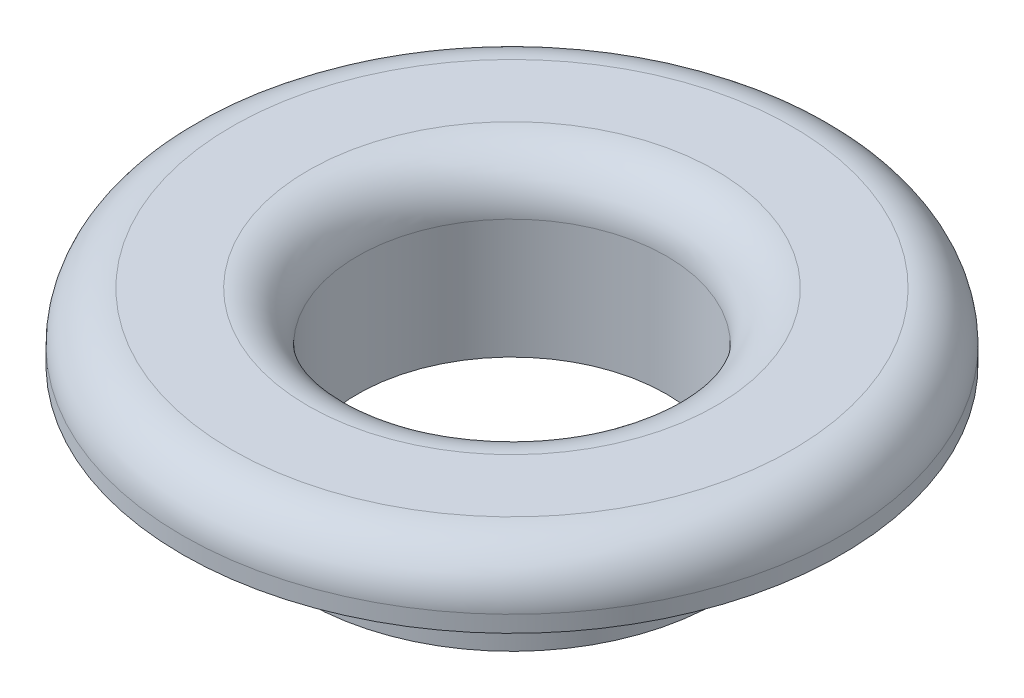
ISO-10303-21;
HEADER;
FILE_DESCRIPTION(('STEP AP214'),'2;1');
FILE_NAME('part.step','',(''),(''),'','','');
FILE_SCHEMA(('AUTOMOTIVE_DESIGN { 1 0 10303 214 1 1 1 1 }'));
ENDSEC;
DATA;
#1=APPLICATION_CONTEXT('core data for automotive mechanical design processes');
#2=APPLICATION_PROTOCOL_DEFINITION('international standard','automotive_design',2000,#1);
#3=PRODUCT_CONTEXT('',#1,'mechanical');
#4=PRODUCT('Part','Part','',(#3));
#5=PRODUCT_RELATED_PRODUCT_CATEGORY('part','',(#4));
#6=PRODUCT_DEFINITION_FORMATION('','',#4);
#7=PRODUCT_DEFINITION_CONTEXT('part definition',#1,'design');
#8=PRODUCT_DEFINITION('design','',#6,#7);
#9=PRODUCT_DEFINITION_SHAPE('','',#8);
#10=(LENGTH_UNIT() NAMED_UNIT(*) SI_UNIT(.MILLI.,.METRE.));
#11=(NAMED_UNIT(*) PLANE_ANGLE_UNIT() SI_UNIT($,.RADIAN.));
#12=(NAMED_UNIT(*) SI_UNIT($,.STERADIAN.) SOLID_ANGLE_UNIT());
#13=UNCERTAINTY_MEASURE_WITH_UNIT(LENGTH_MEASURE(1.E-05),#10,'distance_accuracy_value','');
#14=(GEOMETRIC_REPRESENTATION_CONTEXT(3) GLOBAL_UNCERTAINTY_ASSIGNED_CONTEXT((#13)) GLOBAL_UNIT_ASSIGNED_CONTEXT((#10,
#11,#12)) REPRESENTATION_CONTEXT('',''));
#15=CARTESIAN_POINT('',(0.,0.,0.));
#16=DIRECTION('',(0.,0.,1.));
#17=DIRECTION('',(1.,0.,0.));
#18=AXIS2_PLACEMENT_3D('',#15,#16,#17);
#19=CARTESIAN_POINT('',(0.,0.,0.));
#20=DIRECTION('',(0.,1.,0.));
#21=DIRECTION('',(0.,0.,1.));
#22=AXIS2_PLACEMENT_3D('',#19,#20,#21);
#23=PLANE('',#22);
#24=CARTESIAN_POINT('',(0.,0.,0.));
#25=DIRECTION('',(0.,1.,0.));
#26=DIRECTION('',(0.,0.,1.));
#27=AXIS2_PLACEMENT_3D('',#24,#25,#26);
#28=CIRCLE('',#27,3.175);
#29=CARTESIAN_POINT('',(0.,0.,3.175));
#30=VERTEX_POINT('',#29);
#31=EDGE_CURVE('E51',#30,#30,#28,.T.);
#32=ORIENTED_EDGE('',*,*,#31,.F.);
#33=EDGE_LOOP('',(#32));
#34=FACE_BOUND('',#33,.T.);
#35=CARTESIAN_POINT('',(0.,0.,0.));
#36=DIRECTION('',(0.,1.,0.));
#37=DIRECTION('',(0.,0.,1.));
#38=AXIS2_PLACEMENT_3D('',#35,#36,#37);
#39=CIRCLE('',#38,2.38125);
#40=CARTESIAN_POINT('',(0.,0.,2.38125));
#41=VERTEX_POINT('',#40);
#42=EDGE_CURVE('E54',#41,#41,#39,.T.);
#43=ORIENTED_EDGE('',*,*,#42,.T.);
#44=EDGE_LOOP('',(#43));
#45=FACE_BOUND('',#44,.T.);
#46=ADVANCED_FACE('F30',(#34,#45),#23,.F.);
#47=CARTESIAN_POINT('',(0.,1.5875,0.));
#48=DIRECTION('',(0.,-1.,0.));
#49=DIRECTION('',(0.,0.,-1.));
#50=AXIS2_PLACEMENT_3D('',#47,#48,#49);
#51=CYLINDRICAL_SURFACE('',#50,3.175);
#52=CARTESIAN_POINT('',(0.,1.5875,0.));
#53=DIRECTION('',(0.,1.,0.));
#54=DIRECTION('',(0.,0.,1.));
#55=AXIS2_PLACEMENT_3D('',#52,#53,#54);
#56=CIRCLE('',#55,3.175);
#57=CARTESIAN_POINT('',(0.,1.5875,3.175));
#58=VERTEX_POINT('',#57);
#59=EDGE_CURVE('E50',#58,#58,#56,.T.);
#60=ORIENTED_EDGE('',*,*,#59,.F.);
#61=EDGE_LOOP('',(#60));
#62=FACE_BOUND('',#61,.T.);
#63=ORIENTED_EDGE('',*,*,#31,.T.);
#64=EDGE_LOOP('',(#63));
#65=FACE_BOUND('',#64,.T.);
#66=ADVANCED_FACE('F80',(#62,#65),#51,.T.);
#67=CARTESIAN_POINT('',(0.,1.5875,0.));
#68=DIRECTION('',(0.,-1.,0.));
#69=DIRECTION('',(0.,0.,-1.));
#70=AXIS2_PLACEMENT_3D('',#67,#68,#69);
#71=CYLINDRICAL_SURFACE('',#70,2.38125);
#72=CARTESIAN_POINT('',(0.,1.8415,0.));
#73=DIRECTION('',(0.,1.,0.));
#74=DIRECTION('',(0.,0.,1.));
#75=AXIS2_PLACEMENT_3D('',#72,#73,#74);
#76=CIRCLE('',#75,2.38125);
#77=CARTESIAN_POINT('',(0.,1.8415,2.38125));
#78=VERTEX_POINT('',#77);
#79=EDGE_CURVE('E10',#78,#78,#76,.T.);
#80=ORIENTED_EDGE('',*,*,#79,.T.);
#81=EDGE_LOOP('',(#80));
#82=FACE_BOUND('',#81,.T.);
#83=ORIENTED_EDGE('',*,*,#42,.F.);
#84=EDGE_LOOP('',(#83));
#85=FACE_BOUND('',#84,.T.);
#86=ADVANCED_FACE('F76',(#82,#85),#71,.F.);
#87=CARTESIAN_POINT('',(0.,2.6035,0.));
#88=DIRECTION('',(0.,1.,0.));
#89=DIRECTION('',(0.,0.,1.));
#90=AXIS2_PLACEMENT_3D('',#87,#88,#89);
#91=PLANE('',#90);
#92=CARTESIAN_POINT('',(0.,2.6035,0.));
#93=DIRECTION('',(0.,1.,0.));
#94=DIRECTION('',(0.,0.,1.));
#95=AXIS2_PLACEMENT_3D('',#92,#93,#94);
#96=CIRCLE('',#95,4.318);
#97=CARTESIAN_POINT('',(0.,2.6035,4.318));
#98=VERTEX_POINT('',#97);
#99=EDGE_CURVE('E41',#98,#98,#96,.T.);
#100=ORIENTED_EDGE('',*,*,#99,.T.);
#101=EDGE_LOOP('',(#100));
#102=FACE_BOUND('',#101,.T.);
#103=CARTESIAN_POINT('',(0.,2.6035,0.));
#104=DIRECTION('',(0.,1.,0.));
#105=DIRECTION('',(0.,0.,1.));
#106=AXIS2_PLACEMENT_3D('',#103,#104,#105);
#107=CIRCLE('',#106,3.14325);
#108=CARTESIAN_POINT('',(0.,2.6035,3.14325));
#109=VERTEX_POINT('',#108);
#110=EDGE_CURVE('E45',#109,#109,#107,.F.);
#111=ORIENTED_EDGE('',*,*,#110,.T.);
#112=EDGE_LOOP('',(#111));
#113=FACE_BOUND('',#112,.T.);
#114=ADVANCED_FACE('F67',(#102,#113),#91,.T.);
#115=CARTESIAN_POINT('',(0.,1.5875,0.));
#116=DIRECTION('',(0.,1.,0.));
#117=DIRECTION('',(0.,0.,1.));
#118=AXIS2_PLACEMENT_3D('',#115,#116,#117);
#119=PLANE('',#118);
#120=ORIENTED_EDGE('',*,*,#59,.T.);
#121=EDGE_LOOP('',(#120));
#122=FACE_BOUND('',#121,.T.);
#123=CARTESIAN_POINT('',(0.,1.5875,0.));
#124=DIRECTION('',(0.,1.,0.));
#125=DIRECTION('',(0.,0.,1.));
#126=AXIS2_PLACEMENT_3D('',#123,#124,#125);
#127=CIRCLE('',#126,5.08);
#128=CARTESIAN_POINT('',(0.,1.5875,5.08));
#129=VERTEX_POINT('',#128);
#130=EDGE_CURVE('E59',#129,#129,#127,.T.);
#131=ORIENTED_EDGE('',*,*,#130,.F.);
#132=EDGE_LOOP('',(#131));
#133=FACE_BOUND('',#132,.T.);
#134=ADVANCED_FACE('F65',(#122,#133),#119,.F.);
#135=CARTESIAN_POINT('',(0.,2.6035,0.));
#136=DIRECTION('',(0.,-1.,0.));
#137=DIRECTION('',(0.,0.,-1.));
#138=AXIS2_PLACEMENT_3D('',#135,#136,#137);
#139=CYLINDRICAL_SURFACE('',#138,5.08);
#140=CARTESIAN_POINT('',(0.,1.8415,0.));
#141=DIRECTION('',(0.,1.,0.));
#142=DIRECTION('',(0.,0.,1.));
#143=AXIS2_PLACEMENT_3D('',#140,#141,#142);
#144=CIRCLE('',#143,5.08);
#145=CARTESIAN_POINT('',(0.,1.8415,5.08));
#146=VERTEX_POINT('',#145);
#147=EDGE_CURVE('E37',#146,#146,#144,.F.);
#148=ORIENTED_EDGE('',*,*,#147,.T.);
#149=EDGE_LOOP('',(#148));
#150=FACE_BOUND('',#149,.T.);
#151=ORIENTED_EDGE('',*,*,#130,.T.);
#152=EDGE_LOOP('',(#151));
#153=FACE_BOUND('',#152,.T.);
#154=ADVANCED_FACE('F63',(#150,#153),#139,.T.);
#155=CARTESIAN_POINT('',(0.,1.8415,0.));
#156=DIRECTION('',(0.,1.,0.));
#157=DIRECTION('',(0.,0.,1.));
#158=AXIS2_PLACEMENT_3D('',#155,#156,#157);
#159=TOROIDAL_SURFACE('',#158,4.318,0.762);
#160=ORIENTED_EDGE('',*,*,#147,.F.);
#161=EDGE_LOOP('',(#160));
#162=FACE_BOUND('',#161,.T.);
#163=ORIENTED_EDGE('',*,*,#99,.F.);
#164=EDGE_LOOP('',(#163));
#165=FACE_BOUND('',#164,.T.);
#166=ADVANCED_FACE('F74',(#162,#165),#159,.T.);
#167=CARTESIAN_POINT('',(0.,1.8415,0.));
#168=DIRECTION('',(0.,1.,0.));
#169=DIRECTION('',(0.,0.,1.));
#170=AXIS2_PLACEMENT_3D('',#167,#168,#169);
#171=TOROIDAL_SURFACE('',#170,3.14325,0.762);
#172=ORIENTED_EDGE('',*,*,#110,.F.);
#173=EDGE_LOOP('',(#172));
#174=FACE_BOUND('',#173,.T.);
#175=ORIENTED_EDGE('',*,*,#79,.F.);
#176=EDGE_LOOP('',(#175));
#177=FACE_BOUND('',#176,.T.);
#178=ADVANCED_FACE('F32',(#174,#177),#171,.T.);
#179=CLOSED_SHELL('',(#46,#66,#86,#114,#134,#154,#166,#178));
#180=MANIFOLD_SOLID_BREP('B2',#179);
#181=ADVANCED_BREP_SHAPE_REPRESENTATION('',(#18,#180),#14);
#182=SHAPE_DEFINITION_REPRESENTATION(#9,#181);
ENDSEC;
END-ISO-10303-21;
